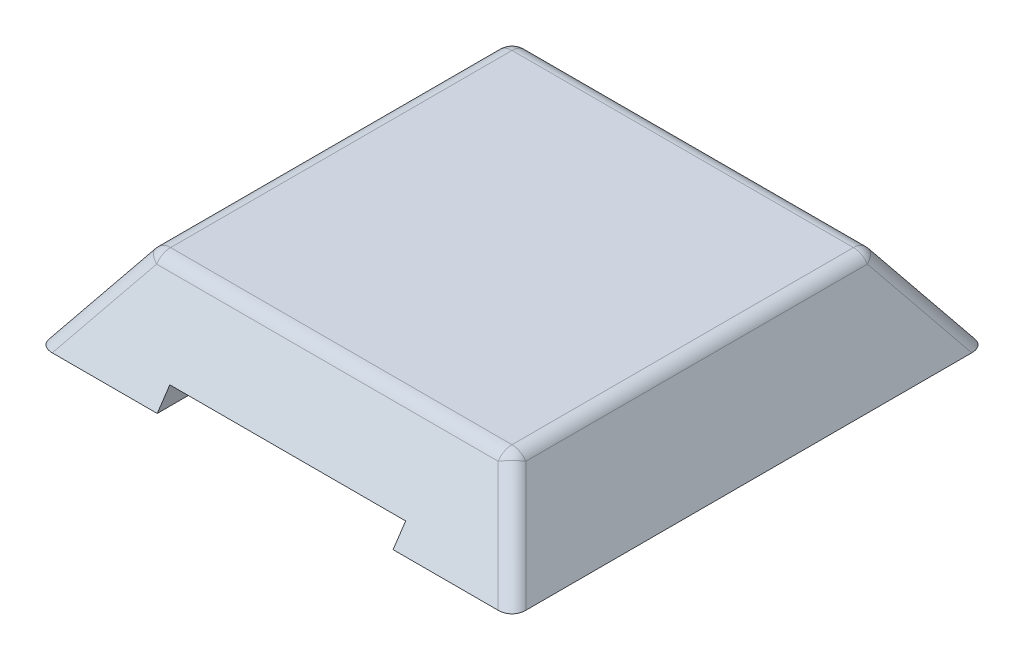
ISO-10303-21;
HEADER;
FILE_DESCRIPTION(('STEP AP214'),'2;1');
FILE_NAME('part.step','',(''),(''),'','','');
FILE_SCHEMA(('AUTOMOTIVE_DESIGN { 1 0 10303 214 1 1 1 1 }'));
ENDSEC;
DATA;
#1=APPLICATION_CONTEXT('core data for automotive mechanical design processes');
#2=APPLICATION_PROTOCOL_DEFINITION('international standard','automotive_design',2000,#1);
#3=PRODUCT_CONTEXT('',#1,'mechanical');
#4=PRODUCT('Part','Part','',(#3));
#5=PRODUCT_RELATED_PRODUCT_CATEGORY('part','',(#4));
#6=PRODUCT_DEFINITION_FORMATION('','',#4);
#7=PRODUCT_DEFINITION_CONTEXT('part definition',#1,'design');
#8=PRODUCT_DEFINITION('design','',#6,#7);
#9=PRODUCT_DEFINITION_SHAPE('','',#8);
#10=(LENGTH_UNIT() NAMED_UNIT(*) SI_UNIT(.MILLI.,.METRE.));
#11=(NAMED_UNIT(*) PLANE_ANGLE_UNIT() SI_UNIT($,.RADIAN.));
#12=(NAMED_UNIT(*) SI_UNIT($,.STERADIAN.) SOLID_ANGLE_UNIT());
#13=UNCERTAINTY_MEASURE_WITH_UNIT(LENGTH_MEASURE(1.E-05),#10,'distance_accuracy_value','');
#14=(GEOMETRIC_REPRESENTATION_CONTEXT(3) GLOBAL_UNCERTAINTY_ASSIGNED_CONTEXT((#13)) GLOBAL_UNIT_ASSIGNED_CONTEXT((#10,
#11,#12)) REPRESENTATION_CONTEXT('',''));
#15=CARTESIAN_POINT('',(0.,0.,0.));
#16=DIRECTION('',(0.,0.,1.));
#17=DIRECTION('',(1.,0.,0.));
#18=AXIS2_PLACEMENT_3D('',#15,#16,#17);
#19=CARTESIAN_POINT('',(0.,0.,0.));
#20=DIRECTION('',(0.,1.,0.));
#21=DIRECTION('',(0.,0.,1.));
#22=AXIS2_PLACEMENT_3D('',#19,#20,#21);
#23=PLANE('',#22);
#24=CARTESIAN_POINT('',(0.,0.,0.));
#25=DIRECTION('',(0.,-1.,0.));
#26=DIRECTION('',(0.,0.,-1.));
#27=AXIS2_PLACEMENT_3D('',#24,#25,#26);
#28=CIRCLE('',#27,1005.32293033056);
#29=CARTESIAN_POINT('',(0.,0.,-1005.32293033056));
#30=VERTEX_POINT('',#29);
#31=EDGE_CURVE('E866',#30,#30,#28,.T.);
#32=ORIENTED_EDGE('',*,*,#31,.F.);
#33=EDGE_LOOP('',(#32));
#34=FACE_BOUND('',#33,.T.);
#35=DIRECTION('',(0.,0.,-1.));
#36=VECTOR('',#35,1.);
#37=CARTESIAN_POINT('',(-700.,0.,0.));
#38=LINE('',#37,#36);
#39=CARTESIAN_POINT('',(-700.,0.,1406.));
#40=VERTEX_POINT('',#39);
#41=CARTESIAN_POINT('',(-700.,0.,1013.));
#42=VERTEX_POINT('',#41);
#43=EDGE_CURVE('E405',#40,#42,#38,.T.);
#44=ORIENTED_EDGE('',*,*,#43,.F.);
#45=DIRECTION('',(1.,0.,0.));
#46=VECTOR('',#45,1.);
#47=CARTESIAN_POINT('',(-1406.,0.,1406.));
#48=LINE('',#47,#46);
#49=CARTESIAN_POINT('',(-1323.28138305122,0.,1406.));
#50=VERTEX_POINT('',#49);
#51=EDGE_CURVE('E557',#50,#40,#48,.T.);
#52=ORIENTED_EDGE('',*,*,#51,.F.);
#53=CARTESIAN_POINT('',(-1285.10823018001,1.11022302462516E-13,1285.10823018001));
#54=DIRECTION('',(0.,1.,0.));
#55=DIRECTION('',(0.707106781186548,0.,-0.707106781186547));
#56=AXIS2_PLACEMENT_3D('',#53,#54,#55);
#57=ELLIPSE('',#56,138.670977570719,100.);
#58=CARTESIAN_POINT('',(-1406.,0.,1323.28138305122));
#59=VERTEX_POINT('',#58);
#60=EDGE_CURVE('E658',#50,#59,#57,.F.);
#61=ORIENTED_EDGE('',*,*,#60,.T.);
#62=DIRECTION('',(0.,0.,1.));
#63=VECTOR('',#62,1.);
#64=CARTESIAN_POINT('',(-1406.,0.,-1406.));
#65=LINE('',#64,#63);
#66=CARTESIAN_POINT('',(-1406.,0.,-1323.28138305122));
#67=VERTEX_POINT('',#66);
#68=EDGE_CURVE('E424',#67,#59,#65,.T.);
#69=ORIENTED_EDGE('',*,*,#68,.F.);
#70=CARTESIAN_POINT('',(-1285.10823018001,0.,-1285.10823018001));
#71=DIRECTION('',(0.,1.,0.));
#72=DIRECTION('',(0.707106781186548,0.,0.707106781186547));
#73=AXIS2_PLACEMENT_3D('',#70,#71,#72);
#74=ELLIPSE('',#73,138.670977570719,100.);
#75=CARTESIAN_POINT('',(-1323.28138305122,0.,-1406.));
#76=VERTEX_POINT('',#75);
#77=EDGE_CURVE('E569',#67,#76,#74,.F.);
#78=ORIENTED_EDGE('',*,*,#77,.T.);
#79=DIRECTION('',(-1.,0.,0.));
#80=VECTOR('',#79,1.);
#81=CARTESIAN_POINT('',(-1406.,0.,-1406.));
#82=LINE('',#81,#80);
#83=CARTESIAN_POINT('',(1323.28138305122,0.,-1406.));
#84=VERTEX_POINT('',#83);
#85=EDGE_CURVE('E418',#84,#76,#82,.T.);
#86=ORIENTED_EDGE('',*,*,#85,.F.);
#87=CARTESIAN_POINT('',(1285.10823018001,0.,-1285.10823018001));
#88=DIRECTION('',(0.,1.,0.));
#89=DIRECTION('',(-0.707106781186547,0.,0.707106781186548));
#90=AXIS2_PLACEMENT_3D('',#87,#88,#89);
#91=ELLIPSE('',#90,138.670977570719,100.);
#92=CARTESIAN_POINT('',(1406.,0.,-1323.28138305122));
#93=VERTEX_POINT('',#92);
#94=EDGE_CURVE('E616',#84,#93,#91,.F.);
#95=ORIENTED_EDGE('',*,*,#94,.T.);
#96=DIRECTION('',(0.,0.,-1.));
#97=VECTOR('',#96,1.);
#98=CARTESIAN_POINT('',(1406.,0.,-1406.));
#99=LINE('',#98,#97);
#100=CARTESIAN_POINT('',(1406.,0.,1323.28138305122));
#101=VERTEX_POINT('',#100);
#102=EDGE_CURVE('E576',#101,#93,#99,.T.);
#103=ORIENTED_EDGE('',*,*,#102,.F.);
#104=CARTESIAN_POINT('',(1285.10823018001,1.11022302462516E-13,1285.10823018001));
#105=DIRECTION('',(0.,1.,0.));
#106=DIRECTION('',(-0.707106781186548,0.,-0.707106781186548));
#107=AXIS2_PLACEMENT_3D('',#104,#105,#106);
#108=ELLIPSE('',#107,138.670977570719,100.);
#109=CARTESIAN_POINT('',(1323.28138305122,0.,1406.));
#110=VERTEX_POINT('',#109);
#111=EDGE_CURVE('E663',#101,#110,#108,.F.);
#112=ORIENTED_EDGE('',*,*,#111,.T.);
#113=CARTESIAN_POINT('',(700.,0.,1406.));
#114=VERTEX_POINT('',#113);
#115=EDGE_CURVE('E431',#114,#110,#48,.T.);
#116=ORIENTED_EDGE('',*,*,#115,.F.);
#117=DIRECTION('',(0.,0.,1.));
#118=VECTOR('',#117,1.);
#119=CARTESIAN_POINT('',(700.,0.,0.));
#120=LINE('',#119,#118);
#121=CARTESIAN_POINT('',(700.,0.,1013.));
#122=VERTEX_POINT('',#121);
#123=EDGE_CURVE('E402',#122,#114,#120,.T.);
#124=ORIENTED_EDGE('',*,*,#123,.F.);
#125=DIRECTION('',(1.,0.,0.));
#126=VECTOR('',#125,1.);
#127=CARTESIAN_POINT('',(0.,0.,1013.));
#128=LINE('',#127,#126);
#129=EDGE_CURVE('E108',#42,#122,#128,.T.);
#130=ORIENTED_EDGE('',*,*,#129,.F.);
#131=EDGE_LOOP('',(#44,#52,#61,#69,#78,#86,#95,#103,#112,#116,#124,#130));
#132=FACE_BOUND('',#131,.T.);
#133=ADVANCED_FACE('F99',(#34,#132),#23,.F.);
#134=CARTESIAN_POINT('',(-1406.,0.,1406.));
#135=DIRECTION('',(0.,0.561927967810891,0.827186169487814));
#136=DIRECTION('',(1.,0.,0.));
#137=AXIS2_PLACEMENT_3D('',#134,#135,#136);
#138=PLANE('',#137);
#139=ORIENTED_EDGE('',*,*,#51,.T.);
#140=DIRECTION('',(0.,0.827186169487814,-0.561927967810891));
#141=VECTOR('',#140,1.);
#142=CARTESIAN_POINT('',(-700.,0.,1406.));
#143=LINE('',#142,#141);
#144=CARTESIAN_POINT('',(-700.,110.,1331.27428680599));
#145=VERTEX_POINT('',#144);
#146=EDGE_CURVE('E755',#40,#145,#143,.T.);
#147=ORIENTED_EDGE('',*,*,#146,.T.);
#148=DIRECTION('',(1.,0.,0.));
#149=VECTOR('',#148,1.);
#150=CARTESIAN_POINT('',(-1406.,110.,1331.27428680599));
#151=LINE('',#150,#149);
#152=CARTESIAN_POINT('',(700.,110.,1331.27428680599));
#153=VERTEX_POINT('',#152);
#154=EDGE_CURVE('E618',#145,#153,#151,.T.);
#155=ORIENTED_EDGE('',*,*,#154,.T.);
#156=DIRECTION('',(0.,-0.827186169487814,0.561927967810891));
#157=VECTOR('',#156,1.);
#158=CARTESIAN_POINT('',(700.,0.,1406.));
#159=LINE('',#158,#157);
#160=EDGE_CURVE('E760',#153,#114,#159,.T.);
#161=ORIENTED_EDGE('',*,*,#160,.T.);
#162=ORIENTED_EDGE('',*,*,#115,.T.);
#163=DIRECTION('',(-0.48988236565481,0.721131427439475,-0.48988236565481));
#164=VECTOR('',#163,1.);
#165=CARTESIAN_POINT('',(668.295521297032,964.172059568059,751.014138245814));
#166=LINE('',#165,#164);
#167=CARTESIAN_POINT('',(1013.37836401997,456.192796781089,1096.09698096876));
#168=VERTEX_POINT('',#167);
#169=EDGE_CURVE('E560',#110,#168,#166,.T.);
#170=ORIENTED_EDGE('',*,*,#169,.T.);
#171=DIRECTION('',(1.,0.,0.));
#172=VECTOR('',#171,1.);
#173=CARTESIAN_POINT('',(-1406.,456.192796781089,1096.09698096876));
#174=LINE('',#173,#172);
#175=CARTESIAN_POINT('',(-1013.37836401997,456.192796781089,1096.09698096876));
#176=VERTEX_POINT('',#175);
#177=EDGE_CURVE('E709',#168,#176,#174,.F.);
#178=ORIENTED_EDGE('',*,*,#177,.T.);
#179=DIRECTION('',(0.489882365654811,0.721131427439474,-0.48988236565481));
#180=VECTOR('',#179,1.);
#181=CARTESIAN_POINT('',(-1343.13258818593,-29.2219702092297,1425.85120513472));
#182=LINE('',#181,#180);
#183=EDGE_CURVE('E563',#176,#50,#182,.F.);
#184=ORIENTED_EDGE('',*,*,#183,.T.);
#185=EDGE_LOOP('',(#139,#147,#155,#161,#162,#170,#178,#184));
#186=FACE_BOUND('',#185,.T.);
#187=ADVANCED_FACE('F450',(#186),#138,.T.);
#188=CARTESIAN_POINT('',(0.,500.,0.));
#189=DIRECTION('',(0.,1.,0.));
#190=DIRECTION('',(0.,0.,1.));
#191=AXIS2_PLACEMENT_3D('',#188,#189,#190);
#192=PLANE('',#191);
#193=DIRECTION('',(0.,0.,1.));
#194=VECTOR('',#193,1.);
#195=CARTESIAN_POINT('',(-1013.37836401997,500.,1.60039259230718E-13));
#196=LINE('',#195,#194);
#197=CARTESIAN_POINT('',(-1013.37836401997,500.,-1013.37836401997));
#198=VERTEX_POINT('',#197);
#199=CARTESIAN_POINT('',(-1013.37836401997,500.,1013.37836401997));
#200=VERTEX_POINT('',#199);
#201=EDGE_CURVE('E729',#198,#200,#196,.T.);
#202=ORIENTED_EDGE('',*,*,#201,.T.);
#203=DIRECTION('',(1.,0.,0.));
#204=VECTOR('',#203,1.);
#205=CARTESIAN_POINT('',(0.,500.,1013.37836401997));
#206=LINE('',#205,#204);
#207=CARTESIAN_POINT('',(1013.37836401997,500.,1013.37836401997));
#208=VERTEX_POINT('',#207);
#209=EDGE_CURVE('E721',#200,#208,#206,.T.);
#210=ORIENTED_EDGE('',*,*,#209,.T.);
#211=DIRECTION('',(0.,0.,-1.));
#212=VECTOR('',#211,1.);
#213=CARTESIAN_POINT('',(1013.37836401997,500.,-1.60039259230718E-13));
#214=LINE('',#213,#212);
#215=CARTESIAN_POINT('',(1013.37836401997,500.,-1013.37836401997));
#216=VERTEX_POINT('',#215);
#217=EDGE_CURVE('E423',#208,#216,#214,.T.);
#218=ORIENTED_EDGE('',*,*,#217,.T.);
#219=DIRECTION('',(-1.,0.,0.));
#220=VECTOR('',#219,1.);
#221=CARTESIAN_POINT('',(0.,500.,-1013.37836401997));
#222=LINE('',#221,#220);
#223=EDGE_CURVE('E743',#216,#198,#222,.T.);
#224=ORIENTED_EDGE('',*,*,#223,.T.);
#225=EDGE_LOOP('',(#202,#210,#218,#224));
#226=FACE_BOUND('',#225,.T.);
#227=ADVANCED_FACE('F458',(#226),#192,.T.);
#228=CARTESIAN_POINT('',(1406.,0.,-1406.));
#229=DIRECTION('',(0.,0.561927967810891,-0.827186169487814));
#230=DIRECTION('',(-1.,0.,0.));
#231=AXIS2_PLACEMENT_3D('',#228,#229,#230);
#232=PLANE('',#231);
#233=DIRECTION('',(-1.,0.,0.));
#234=VECTOR('',#233,1.);
#235=CARTESIAN_POINT('',(1406.,456.192796781089,-1096.09698096876));
#236=LINE('',#235,#234);
#237=CARTESIAN_POINT('',(-1013.37836401997,456.192796781089,-1096.09698096876));
#238=VERTEX_POINT('',#237);
#239=CARTESIAN_POINT('',(1013.37836401997,456.192796781089,-1096.09698096876));
#240=VERTEX_POINT('',#239);
#241=EDGE_CURVE('E602',#238,#240,#236,.F.);
#242=ORIENTED_EDGE('',*,*,#241,.T.);
#243=DIRECTION('',(-0.48988236565481,0.721131427439475,0.48988236565481));
#244=VECTOR('',#243,1.);
#245=CARTESIAN_POINT('',(1343.13258818593,-29.2219702092298,-1425.85120513472));
#246=LINE('',#245,#244);
#247=EDGE_CURVE('E604',#240,#84,#246,.F.);
#248=ORIENTED_EDGE('',*,*,#247,.T.);
#249=ORIENTED_EDGE('',*,*,#85,.T.);
#250=DIRECTION('',(0.489882365654811,0.721131427439474,0.48988236565481));
#251=VECTOR('',#250,1.);
#252=CARTESIAN_POINT('',(-668.295521297031,964.172059568059,-751.014138245813));
#253=LINE('',#252,#251);
#254=EDGE_CURVE('E605',#76,#238,#253,.T.);
#255=ORIENTED_EDGE('',*,*,#254,.T.);
#256=EDGE_LOOP('',(#242,#248,#249,#255));
#257=FACE_BOUND('',#256,.T.);
#258=ADVANCED_FACE('F587',(#257),#232,.T.);
#259=CARTESIAN_POINT('',(1406.,0.,1406.));
#260=DIRECTION('',(0.827186169487814,0.561927967810891,0.));
#261=DIRECTION('',(0.,0.,-1.));
#262=AXIS2_PLACEMENT_3D('',#259,#260,#261);
#263=PLANE('',#262);
#264=DIRECTION('',(0.,0.,-1.));
#265=VECTOR('',#264,1.);
#266=CARTESIAN_POINT('',(1096.09698096876,456.192796781089,1406.));
#267=LINE('',#266,#265);
#268=CARTESIAN_POINT('',(1096.09698096876,456.192796781089,-1013.37836401997));
#269=VERTEX_POINT('',#268);
#270=CARTESIAN_POINT('',(1096.09698096876,456.192796781089,1013.37836401997));
#271=VERTEX_POINT('',#270);
#272=EDGE_CURVE('E608',#269,#271,#267,.F.);
#273=ORIENTED_EDGE('',*,*,#272,.T.);
#274=DIRECTION('',(-0.48988236565481,0.721131427439475,-0.48988236565481));
#275=VECTOR('',#274,1.);
#276=CARTESIAN_POINT('',(1425.85120513472,-29.2219702092297,1343.13258818593));
#277=LINE('',#276,#275);
#278=EDGE_CURVE('E648',#271,#101,#277,.F.);
#279=ORIENTED_EDGE('',*,*,#278,.T.);
#280=ORIENTED_EDGE('',*,*,#102,.T.);
#281=DIRECTION('',(-0.48988236565481,0.721131427439475,0.48988236565481));
#282=VECTOR('',#281,1.);
#283=CARTESIAN_POINT('',(751.014138245813,964.172059568059,-668.295521297032));
#284=LINE('',#283,#282);
#285=EDGE_CURVE('E653',#93,#269,#284,.T.);
#286=ORIENTED_EDGE('',*,*,#285,.T.);
#287=EDGE_LOOP('',(#273,#279,#280,#286));
#288=FACE_BOUND('',#287,.T.);
#289=ADVANCED_FACE('F459',(#288),#263,.T.);
#290=CARTESIAN_POINT('',(-1406.,0.,-1406.));
#291=DIRECTION('',(-0.827186169487813,0.561927967810892,0.));
#292=DIRECTION('',(0.,0.,1.));
#293=AXIS2_PLACEMENT_3D('',#290,#291,#292);
#294=PLANE('',#293);
#295=ORIENTED_EDGE('',*,*,#68,.T.);
#296=DIRECTION('',(0.489882365654811,0.721131427439474,-0.48988236565481));
#297=VECTOR('',#296,1.);
#298=CARTESIAN_POINT('',(-751.014138245813,964.172059568058,668.295521297034));
#299=LINE('',#298,#297);
#300=CARTESIAN_POINT('',(-1096.09698096876,456.192796781089,1013.37836401997));
#301=VERTEX_POINT('',#300);
#302=EDGE_CURVE('E564',#59,#301,#299,.T.);
#303=ORIENTED_EDGE('',*,*,#302,.T.);
#304=DIRECTION('',(0.,0.,1.));
#305=VECTOR('',#304,1.);
#306=CARTESIAN_POINT('',(-1096.09698096876,456.192796781089,-1406.));
#307=LINE('',#306,#305);
#308=CARTESIAN_POINT('',(-1096.09698096876,456.192796781089,-1013.37836401997));
#309=VERTEX_POINT('',#308);
#310=EDGE_CURVE('E609',#301,#309,#307,.F.);
#311=ORIENTED_EDGE('',*,*,#310,.T.);
#312=DIRECTION('',(0.489882365654811,0.721131427439474,0.48988236565481));
#313=VECTOR('',#312,1.);
#314=CARTESIAN_POINT('',(-1425.85120513472,-29.2219702092296,-1343.13258818593));
#315=LINE('',#314,#313);
#316=EDGE_CURVE('E680',#309,#67,#315,.F.);
#317=ORIENTED_EDGE('',*,*,#316,.T.);
#318=EDGE_LOOP('',(#295,#303,#311,#317));
#319=FACE_BOUND('',#318,.T.);
#320=ADVANCED_FACE('F462',(#319),#294,.T.);
#321=CARTESIAN_POINT('',(0.,400.,-1013.37836401997));
#322=DIRECTION('',(-1.,0.,0.));
#323=DIRECTION('',(0.,0.,1.));
#324=AXIS2_PLACEMENT_3D('',#321,#322,#323);
#325=CYLINDRICAL_SURFACE('',#324,100.);
#326=ORIENTED_EDGE('',*,*,#223,.F.);
#327=CARTESIAN_POINT('',(1013.37836401997,400.,-1013.37836401997));
#328=DIRECTION('',(-1.,0.,0.));
#329=DIRECTION('',(0.,0.,1.));
#330=AXIS2_PLACEMENT_3D('',#327,#328,#329);
#331=CIRCLE('',#330,100.);
#332=EDGE_CURVE('E620',#216,#240,#331,.T.);
#333=ORIENTED_EDGE('',*,*,#332,.T.);
#334=ORIENTED_EDGE('',*,*,#241,.F.);
#335=CARTESIAN_POINT('',(-1013.37836401997,400.,-1013.37836401997));
#336=DIRECTION('',(-1.,0.,0.));
#337=DIRECTION('',(0.,0.,1.));
#338=AXIS2_PLACEMENT_3D('',#335,#336,#337);
#339=CIRCLE('',#338,100.);
#340=EDGE_CURVE('E683',#238,#198,#339,.F.);
#341=ORIENTED_EDGE('',*,*,#340,.T.);
#342=EDGE_LOOP('',(#326,#333,#334,#341));
#343=FACE_BOUND('',#342,.T.);
#344=ADVANCED_FACE('F466',(#343),#325,.T.);
#345=CARTESIAN_POINT('',(-1013.37836401997,400.,1.60039259230718E-13));
#346=DIRECTION('',(0.,0.,1.));
#347=DIRECTION('',(1.,0.,0.));
#348=AXIS2_PLACEMENT_3D('',#345,#346,#347);
#349=CYLINDRICAL_SURFACE('',#348,100.);
#350=ORIENTED_EDGE('',*,*,#310,.F.);
#351=CARTESIAN_POINT('',(-1013.37836401997,400.,1013.37836401997));
#352=DIRECTION('',(0.,0.,1.));
#353=DIRECTION('',(1.,0.,0.));
#354=AXIS2_PLACEMENT_3D('',#351,#352,#353);
#355=CIRCLE('',#354,100.);
#356=EDGE_CURVE('E706',#301,#200,#355,.F.);
#357=ORIENTED_EDGE('',*,*,#356,.T.);
#358=ORIENTED_EDGE('',*,*,#201,.F.);
#359=CARTESIAN_POINT('',(-1013.37836401997,400.,-1013.37836401997));
#360=DIRECTION('',(0.,0.,1.));
#361=DIRECTION('',(1.,0.,0.));
#362=AXIS2_PLACEMENT_3D('',#359,#360,#361);
#363=CIRCLE('',#362,100.);
#364=EDGE_CURVE('E682',#198,#309,#363,.T.);
#365=ORIENTED_EDGE('',*,*,#364,.T.);
#366=EDGE_LOOP('',(#350,#357,#358,#365));
#367=FACE_BOUND('',#366,.T.);
#368=ADVANCED_FACE('F476',(#367),#349,.T.);
#369=CARTESIAN_POINT('',(1013.37836401997,400.,-1.60039259230718E-13));
#370=DIRECTION('',(0.,0.,-1.));
#371=DIRECTION('',(-1.,0.,0.));
#372=AXIS2_PLACEMENT_3D('',#369,#370,#371);
#373=CYLINDRICAL_SURFACE('',#372,100.);
#374=ORIENTED_EDGE('',*,*,#217,.F.);
#375=CARTESIAN_POINT('',(1013.37836401997,400.,1013.37836401997));
#376=DIRECTION('',(0.,0.,-1.));
#377=DIRECTION('',(-1.,0.,0.));
#378=AXIS2_PLACEMENT_3D('',#375,#376,#377);
#379=CIRCLE('',#378,100.);
#380=EDGE_CURVE('E687',#208,#271,#379,.T.);
#381=ORIENTED_EDGE('',*,*,#380,.T.);
#382=ORIENTED_EDGE('',*,*,#272,.F.);
#383=CARTESIAN_POINT('',(1013.37836401997,400.,-1013.37836401997));
#384=DIRECTION('',(0.,0.,-1.));
#385=DIRECTION('',(-1.,0.,0.));
#386=AXIS2_PLACEMENT_3D('',#383,#384,#385);
#387=CIRCLE('',#386,100.);
#388=EDGE_CURVE('E622',#269,#216,#387,.F.);
#389=ORIENTED_EDGE('',*,*,#388,.T.);
#390=EDGE_LOOP('',(#374,#381,#382,#389));
#391=FACE_BOUND('',#390,.T.);
#392=ADVANCED_FACE('F472',(#391),#373,.T.);
#393=CARTESIAN_POINT('',(0.,400.,1013.37836401997));
#394=DIRECTION('',(1.,0.,0.));
#395=DIRECTION('',(0.,0.,-1.));
#396=AXIS2_PLACEMENT_3D('',#393,#394,#395);
#397=CYLINDRICAL_SURFACE('',#396,100.);
#398=ORIENTED_EDGE('',*,*,#209,.F.);
#399=CARTESIAN_POINT('',(-1013.37836401997,400.,1013.37836401997));
#400=DIRECTION('',(1.,0.,0.));
#401=DIRECTION('',(0.,0.,-1.));
#402=AXIS2_PLACEMENT_3D('',#399,#400,#401);
#403=CIRCLE('',#402,100.);
#404=EDGE_CURVE('E712',#200,#176,#403,.T.);
#405=ORIENTED_EDGE('',*,*,#404,.T.);
#406=ORIENTED_EDGE('',*,*,#177,.F.);
#407=CARTESIAN_POINT('',(1013.37836401997,400.,1013.37836401997));
#408=DIRECTION('',(1.,0.,0.));
#409=DIRECTION('',(0.,0.,-1.));
#410=AXIS2_PLACEMENT_3D('',#407,#408,#409);
#411=CIRCLE('',#410,100.);
#412=EDGE_CURVE('E723',#168,#208,#411,.F.);
#413=ORIENTED_EDGE('',*,*,#412,.T.);
#414=EDGE_LOOP('',(#398,#405,#406,#413));
#415=FACE_BOUND('',#414,.T.);
#416=ADVANCED_FACE('F468',(#415),#397,.T.);
#417=CARTESIAN_POINT('',(-668.295521297032,907.979262786968,668.295521297033));
#418=DIRECTION('',(0.489882365654811,0.721131427439474,-0.48988236565481));
#419=DIRECTION('',(-0.827186169487813,0.561927967810891,0.));
#420=AXIS2_PLACEMENT_3D('',#417,#418,#419);
#421=CYLINDRICAL_SURFACE('',#420,100.);
#422=ORIENTED_EDGE('',*,*,#60,.F.);
#423=ORIENTED_EDGE('',*,*,#183,.F.);
#424=CARTESIAN_POINT('',(-1013.37836401997,400.,1013.37836401997));
#425=DIRECTION('',(0.489882365654811,0.721131427439475,-0.489882365654809));
#426=DIRECTION('',(-0.827186169487814,0.561927967810891,0.));
#427=AXIS2_PLACEMENT_3D('',#424,#425,#426);
#428=CIRCLE('',#427,100.);
#429=EDGE_CURVE('E629',#301,#176,#428,.T.);
#430=ORIENTED_EDGE('',*,*,#429,.F.);
#431=ORIENTED_EDGE('',*,*,#302,.F.);
#432=EDGE_LOOP('',(#422,#423,#430,#431));
#433=FACE_BOUND('',#432,.T.);
#434=ADVANCED_FACE('F471',(#433),#421,.T.);
#435=CARTESIAN_POINT('',(-1013.37836401997,400.,1013.37836401997));
#436=DIRECTION('',(0.,0.,1.));
#437=DIRECTION('',(1.,0.,0.));
#438=AXIS2_PLACEMENT_3D('',#435,#436,#437);
#439=SPHERICAL_SURFACE('',#438,100.);
#440=ORIENTED_EDGE('',*,*,#404,.F.);
#441=ORIENTED_EDGE('',*,*,#356,.F.);
#442=ORIENTED_EDGE('',*,*,#429,.T.);
#443=EDGE_LOOP('',(#440,#441,#442));
#444=FACE_BOUND('',#443,.T.);
#445=ADVANCED_FACE('F484',(#444),#439,.T.);
#446=CARTESIAN_POINT('',(668.295521297032,907.979262786969,668.295521297032));
#447=DIRECTION('',(-0.48988236565481,0.721131427439475,-0.48988236565481));
#448=DIRECTION('',(0.,0.561927967810891,0.827186169487814));
#449=AXIS2_PLACEMENT_3D('',#446,#447,#448);
#450=CYLINDRICAL_SURFACE('',#449,100.);
#451=ORIENTED_EDGE('',*,*,#111,.F.);
#452=ORIENTED_EDGE('',*,*,#278,.F.);
#453=CARTESIAN_POINT('',(1013.37836401997,400.,1013.37836401997));
#454=DIRECTION('',(-0.48988236565481,0.721131427439475,-0.48988236565481));
#455=DIRECTION('',(0.,0.56192796781089,0.827186169487814));
#456=AXIS2_PLACEMENT_3D('',#453,#454,#455);
#457=CIRCLE('',#456,100.);
#458=EDGE_CURVE('E624',#168,#271,#457,.T.);
#459=ORIENTED_EDGE('',*,*,#458,.F.);
#460=ORIENTED_EDGE('',*,*,#169,.F.);
#461=EDGE_LOOP('',(#451,#452,#459,#460));
#462=FACE_BOUND('',#461,.T.);
#463=ADVANCED_FACE('F487',(#462),#450,.T.);
#464=CARTESIAN_POINT('',(1013.37836401997,400.,1013.37836401997));
#465=DIRECTION('',(0.,0.,1.));
#466=DIRECTION('',(1.,0.,0.));
#467=AXIS2_PLACEMENT_3D('',#464,#465,#466);
#468=SPHERICAL_SURFACE('',#467,100.);
#469=ORIENTED_EDGE('',*,*,#458,.T.);
#470=ORIENTED_EDGE('',*,*,#380,.F.);
#471=ORIENTED_EDGE('',*,*,#412,.F.);
#472=EDGE_LOOP('',(#469,#470,#471));
#473=FACE_BOUND('',#472,.T.);
#474=ADVANCED_FACE('F492',(#473),#468,.T.);
#475=CARTESIAN_POINT('',(668.295521297031,907.97926278697,-668.295521297032));
#476=DIRECTION('',(-0.48988236565481,0.721131427439475,0.48988236565481));
#477=DIRECTION('',(0.,-0.561927967810891,0.827186169487814));
#478=AXIS2_PLACEMENT_3D('',#475,#476,#477);
#479=CYLINDRICAL_SURFACE('',#478,100.);
#480=ORIENTED_EDGE('',*,*,#94,.F.);
#481=ORIENTED_EDGE('',*,*,#247,.F.);
#482=CARTESIAN_POINT('',(1013.37836401997,400.,-1013.37836401997));
#483=DIRECTION('',(-0.48988236565481,0.721131427439475,0.489882365654809));
#484=DIRECTION('',(-0.827186169487814,-0.56192796781089,0.));
#485=AXIS2_PLACEMENT_3D('',#482,#483,#484);
#486=CIRCLE('',#485,100.);
#487=EDGE_CURVE('E614',#269,#240,#486,.T.);
#488=ORIENTED_EDGE('',*,*,#487,.F.);
#489=ORIENTED_EDGE('',*,*,#285,.F.);
#490=EDGE_LOOP('',(#480,#481,#488,#489));
#491=FACE_BOUND('',#490,.T.);
#492=ADVANCED_FACE('F495',(#491),#479,.T.);
#493=CARTESIAN_POINT('',(1013.37836401997,400.,-1013.37836401997));
#494=DIRECTION('',(0.,0.,1.));
#495=DIRECTION('',(1.,0.,0.));
#496=AXIS2_PLACEMENT_3D('',#493,#494,#495);
#497=SPHERICAL_SURFACE('',#496,100.);
#498=ORIENTED_EDGE('',*,*,#487,.T.);
#499=ORIENTED_EDGE('',*,*,#332,.F.);
#500=ORIENTED_EDGE('',*,*,#388,.F.);
#501=EDGE_LOOP('',(#498,#499,#500));
#502=FACE_BOUND('',#501,.T.);
#503=ADVANCED_FACE('F500',(#502),#497,.T.);
#504=CARTESIAN_POINT('',(-668.295521297031,907.97926278697,-668.295521297031));
#505=DIRECTION('',(0.489882365654811,0.721131427439474,0.48988236565481));
#506=DIRECTION('',(-0.827186169487813,0.561927967810892,0.));
#507=AXIS2_PLACEMENT_3D('',#504,#505,#506);
#508=CYLINDRICAL_SURFACE('',#507,100.);
#509=ORIENTED_EDGE('',*,*,#77,.F.);
#510=ORIENTED_EDGE('',*,*,#316,.F.);
#511=CARTESIAN_POINT('',(-1013.37836401997,400.,-1013.37836401997));
#512=DIRECTION('',(0.489882365654812,0.721131427439474,0.489882365654809));
#513=DIRECTION('',(-0.827186169487813,0.561927967810893,0.));
#514=AXIS2_PLACEMENT_3D('',#511,#512,#513);
#515=CIRCLE('',#514,100.);
#516=EDGE_CURVE('E410',#238,#309,#515,.T.);
#517=ORIENTED_EDGE('',*,*,#516,.F.);
#518=ORIENTED_EDGE('',*,*,#254,.F.);
#519=EDGE_LOOP('',(#509,#510,#517,#518));
#520=FACE_BOUND('',#519,.T.);
#521=ADVANCED_FACE('F101',(#520),#508,.T.);
#522=CARTESIAN_POINT('',(-1013.37836401997,400.,-1013.37836401997));
#523=DIRECTION('',(0.,0.,1.));
#524=DIRECTION('',(1.,0.,0.));
#525=AXIS2_PLACEMENT_3D('',#522,#523,#524);
#526=SPHERICAL_SURFACE('',#525,100.);
#527=ORIENTED_EDGE('',*,*,#364,.F.);
#528=ORIENTED_EDGE('',*,*,#340,.F.);
#529=ORIENTED_EDGE('',*,*,#516,.T.);
#530=EDGE_LOOP('',(#527,#528,#529));
#531=FACE_BOUND('',#530,.T.);
#532=ADVANCED_FACE('F506',(#531),#526,.T.);
#533=CARTESIAN_POINT('',(0.,0.,1013.));
#534=DIRECTION('',(0.,0.,1.));
#535=DIRECTION('',(1.,0.,0.));
#536=AXIS2_PLACEMENT_3D('',#533,#534,#535);
#537=PLANE('',#536);
#538=ORIENTED_EDGE('',*,*,#129,.T.);
#539=DIRECTION('',(0.,1.,0.));
#540=VECTOR('',#539,1.);
#541=CARTESIAN_POINT('',(700.,-110.,1013.));
#542=LINE('',#541,#540);
#543=CARTESIAN_POINT('',(700.,110.,1013.));
#544=VERTEX_POINT('',#543);
#545=EDGE_CURVE('E388',#122,#544,#542,.T.);
#546=ORIENTED_EDGE('',*,*,#545,.T.);
#547=DIRECTION('',(-1.,0.,0.));
#548=VECTOR('',#547,1.);
#549=CARTESIAN_POINT('',(700.,110.,1013.));
#550=LINE('',#549,#548);
#551=CARTESIAN_POINT('',(-700.,110.,1013.));
#552=VERTEX_POINT('',#551);
#553=EDGE_CURVE('E391',#544,#552,#550,.T.);
#554=ORIENTED_EDGE('',*,*,#553,.T.);
#555=DIRECTION('',(0.,-1.,0.));
#556=VECTOR('',#555,1.);
#557=CARTESIAN_POINT('',(-700.,-110.,1013.));
#558=LINE('',#557,#556);
#559=EDGE_CURVE('E384',#552,#42,#558,.T.);
#560=ORIENTED_EDGE('',*,*,#559,.T.);
#561=EDGE_LOOP('',(#538,#546,#554,#560));
#562=FACE_BOUND('',#561,.T.);
#563=ADVANCED_FACE('F508',(#562),#537,.T.);
#564=CARTESIAN_POINT('',(-700.,-110.,1513.));
#565=DIRECTION('',(1.,0.,0.));
#566=DIRECTION('',(0.,0.,-1.));
#567=AXIS2_PLACEMENT_3D('',#564,#565,#566);
#568=PLANE('',#567);
#569=ORIENTED_EDGE('',*,*,#43,.T.);
#570=ORIENTED_EDGE('',*,*,#559,.F.);
#571=DIRECTION('',(0.,0.,-1.));
#572=VECTOR('',#571,1.);
#573=CARTESIAN_POINT('',(-700.,110.,1513.));
#574=LINE('',#573,#572);
#575=EDGE_CURVE('E395',#145,#552,#574,.T.);
#576=ORIENTED_EDGE('',*,*,#575,.F.);
#577=ORIENTED_EDGE('',*,*,#146,.F.);
#578=EDGE_LOOP('',(#569,#570,#576,#577));
#579=FACE_BOUND('',#578,.T.);
#580=ADVANCED_FACE('F514',(#579),#568,.T.);
#581=CARTESIAN_POINT('',(700.,-110.,1513.));
#582=DIRECTION('',(-1.,0.,0.));
#583=DIRECTION('',(0.,0.,1.));
#584=AXIS2_PLACEMENT_3D('',#581,#582,#583);
#585=PLANE('',#584);
#586=ORIENTED_EDGE('',*,*,#123,.T.);
#587=ORIENTED_EDGE('',*,*,#160,.F.);
#588=DIRECTION('',(0.,0.,-1.));
#589=VECTOR('',#588,1.);
#590=CARTESIAN_POINT('',(700.,110.,1513.));
#591=LINE('',#590,#589);
#592=EDGE_CURVE('E398',#153,#544,#591,.T.);
#593=ORIENTED_EDGE('',*,*,#592,.T.);
#594=ORIENTED_EDGE('',*,*,#545,.F.);
#595=EDGE_LOOP('',(#586,#587,#593,#594));
#596=FACE_BOUND('',#595,.T.);
#597=ADVANCED_FACE('F777',(#596),#585,.T.);
#598=CARTESIAN_POINT('',(700.,110.,1513.));
#599=DIRECTION('',(0.,-1.,0.));
#600=DIRECTION('',(1.,0.,0.));
#601=AXIS2_PLACEMENT_3D('',#598,#599,#600);
#602=PLANE('',#601);
#603=ORIENTED_EDGE('',*,*,#575,.T.);
#604=ORIENTED_EDGE('',*,*,#553,.F.);
#605=ORIENTED_EDGE('',*,*,#592,.F.);
#606=ORIENTED_EDGE('',*,*,#154,.F.);
#607=EDGE_LOOP('',(#603,#604,#605,#606));
#608=FACE_BOUND('',#607,.T.);
#609=ADVANCED_FACE('F769',(#608),#602,.T.);
#610=CARTESIAN_POINT('',(0.,-5.,0.));
#611=DIRECTION('',(0.,1.,0.));
#612=DIRECTION('',(0.,0.,1.));
#613=AXIS2_PLACEMENT_3D('',#610,#611,#612);
#614=CYLINDRICAL_SURFACE('',#613,1005.32293033056);
#615=CARTESIAN_POINT('',(0.,-5.,0.));
#616=DIRECTION('',(0.,-1.,0.));
#617=DIRECTION('',(0.,0.,-1.));
#618=AXIS2_PLACEMENT_3D('',#615,#616,#617);
#619=CIRCLE('',#618,1005.32293033056);
#620=CARTESIAN_POINT('',(710.870661319072,-5.,-710.870661319072));
#621=VERTEX_POINT('',#620);
#622=CARTESIAN_POINT('',(710.870661319072,-5.,710.870661319072));
#623=VERTEX_POINT('',#622);
#624=EDGE_CURVE('E295',#621,#623,#619,.T.);
#625=ORIENTED_EDGE('',*,*,#624,.F.);
#626=CARTESIAN_POINT('',(-710.870661319072,-5.,-710.870661319072));
#627=VERTEX_POINT('',#626);
#628=EDGE_CURVE('E860',#627,#621,#619,.T.);
#629=ORIENTED_EDGE('',*,*,#628,.F.);
#630=CARTESIAN_POINT('',(-710.870661319072,-5.,710.870661319072));
#631=VERTEX_POINT('',#630);
#632=EDGE_CURVE('E863',#631,#627,#619,.T.);
#633=ORIENTED_EDGE('',*,*,#632,.F.);
#634=EDGE_CURVE('E858',#623,#631,#619,.T.);
#635=ORIENTED_EDGE('',*,*,#634,.F.);
#636=EDGE_LOOP('',(#625,#629,#633,#635));
#637=FACE_BOUND('',#636,.T.);
#638=ORIENTED_EDGE('',*,*,#31,.T.);
#639=EDGE_LOOP('',(#638));
#640=FACE_BOUND('',#639,.T.);
#641=ADVANCED_FACE('F783',(#637,#640),#614,.T.);
#642=CARTESIAN_POINT('',(0.,-5.,0.));
#643=DIRECTION('',(0.,-1.,0.));
#644=DIRECTION('',(0.,0.,-1.));
#645=AXIS2_PLACEMENT_3D('',#642,#643,#644);
#646=PLANE('',#645);
#647=DIRECTION('',(1.,0.,0.));
#648=VECTOR('',#647,1.);
#649=CARTESIAN_POINT('',(0.,-5.,-710.870661319072));
#650=LINE('',#649,#648);
#651=CARTESIAN_POINT('',(410.870661319072,-5.,-710.870661319072));
#652=VERTEX_POINT('',#651);
#653=EDGE_CURVE('E122',#652,#621,#650,.T.);
#654=ORIENTED_EDGE('',*,*,#653,.F.);
#655=DIRECTION('',(0.,0.,1.));
#656=VECTOR('',#655,1.);
#657=CARTESIAN_POINT('',(410.870661319072,-5.,0.));
#658=LINE('',#657,#656);
#659=CARTESIAN_POINT('',(410.870661319072,-5.,-110.870661319072));
#660=VERTEX_POINT('',#659);
#661=EDGE_CURVE('E115',#652,#660,#658,.T.);
#662=ORIENTED_EDGE('',*,*,#661,.T.);
#663=DIRECTION('',(-1.,0.,0.));
#664=VECTOR('',#663,1.);
#665=CARTESIAN_POINT('',(0.,-5.,-110.870661319072));
#666=LINE('',#665,#664);
#667=CARTESIAN_POINT('',(-404.434082872768,-5.,-110.870661319072));
#668=VERTEX_POINT('',#667);
#669=EDGE_CURVE('E13',#660,#668,#666,.T.);
#670=ORIENTED_EDGE('',*,*,#669,.T.);
#671=DIRECTION('',(0.,0.,1.));
#672=VECTOR('',#671,1.);
#673=CARTESIAN_POINT('',(-404.434082872768,-5.,0.));
#674=LINE('',#673,#672);
#675=CARTESIAN_POINT('',(-404.434082872768,-5.,-710.870661319072));
#676=VERTEX_POINT('',#675);
#677=EDGE_CURVE('E288',#676,#668,#674,.T.);
#678=ORIENTED_EDGE('',*,*,#677,.F.);
#679=DIRECTION('',(1.,0.,0.));
#680=VECTOR('',#679,1.);
#681=CARTESIAN_POINT('',(0.,-5.,-710.870661319072));
#682=LINE('',#681,#680);
#683=EDGE_CURVE('E294',#627,#676,#682,.T.);
#684=ORIENTED_EDGE('',*,*,#683,.F.);
#685=ORIENTED_EDGE('',*,*,#628,.T.);
#686=EDGE_LOOP('',(#654,#662,#670,#678,#684,#685));
#687=FACE_BOUND('',#686,.T.);
#688=ADVANCED_FACE('F297',(#687),#646,.T.);
#689=ORIENTED_EDGE('',*,*,#624,.T.);
#690=DIRECTION('',(0.,0.,-1.));
#691=VECTOR('',#690,1.);
#692=CARTESIAN_POINT('',(710.870661319072,-5.,1.11022302462516E-13));
#693=LINE('',#692,#691);
#694=EDGE_CURVE('E307',#623,#621,#693,.T.);
#695=ORIENTED_EDGE('',*,*,#694,.T.);
#696=EDGE_LOOP('',(#689,#695));
#697=FACE_BOUND('',#696,.T.);
#698=ADVANCED_FACE('F842',(#697),#646,.T.);
#699=DIRECTION('',(0.,0.,-1.));
#700=VECTOR('',#699,1.);
#701=CARTESIAN_POINT('',(-710.870661319072,-5.,-1.11022302462516E-13));
#702=LINE('',#701,#700);
#703=EDGE_CURVE('E875',#631,#627,#702,.T.);
#704=ORIENTED_EDGE('',*,*,#703,.F.);
#705=ORIENTED_EDGE('',*,*,#632,.T.);
#706=EDGE_LOOP('',(#704,#705));
#707=FACE_BOUND('',#706,.T.);
#708=ADVANCED_FACE('F837',(#707),#646,.T.);
#709=DIRECTION('',(0.,0.,-1.));
#710=VECTOR('',#709,1.);
#711=CARTESIAN_POINT('',(410.870661319072,-5.,0.));
#712=LINE('',#711,#710);
#713=CARTESIAN_POINT('',(410.870661319072,-5.,710.870661319072));
#714=VERTEX_POINT('',#713);
#715=CARTESIAN_POINT('',(410.870661319072,-5.,110.870661319072));
#716=VERTEX_POINT('',#715);
#717=EDGE_CURVE('E889',#714,#716,#712,.T.);
#718=ORIENTED_EDGE('',*,*,#717,.F.);
#719=DIRECTION('',(1.,0.,0.));
#720=VECTOR('',#719,1.);
#721=CARTESIAN_POINT('',(0.,-5.,710.870661319072));
#722=LINE('',#721,#720);
#723=EDGE_CURVE('E892',#714,#623,#722,.T.);
#724=ORIENTED_EDGE('',*,*,#723,.T.);
#725=ORIENTED_EDGE('',*,*,#634,.T.);
#726=DIRECTION('',(1.,0.,0.));
#727=VECTOR('',#726,1.);
#728=CARTESIAN_POINT('',(0.,-5.,710.870661319072));
#729=LINE('',#728,#727);
#730=CARTESIAN_POINT('',(-404.434082872768,-5.,710.870661319072));
#731=VERTEX_POINT('',#730);
#732=EDGE_CURVE('E878',#631,#731,#729,.T.);
#733=ORIENTED_EDGE('',*,*,#732,.T.);
#734=DIRECTION('',(0.,0.,-1.));
#735=VECTOR('',#734,1.);
#736=CARTESIAN_POINT('',(-404.434082872768,-5.,0.));
#737=LINE('',#736,#735);
#738=CARTESIAN_POINT('',(-404.434082872768,-5.,110.870661319072));
#739=VERTEX_POINT('',#738);
#740=EDGE_CURVE('E882',#731,#739,#737,.T.);
#741=ORIENTED_EDGE('',*,*,#740,.T.);
#742=DIRECTION('',(-1.,0.,0.));
#743=VECTOR('',#742,1.);
#744=CARTESIAN_POINT('',(0.,-5.,110.870661319072));
#745=LINE('',#744,#743);
#746=EDGE_CURVE('E886',#716,#739,#745,.T.);
#747=ORIENTED_EDGE('',*,*,#746,.F.);
#748=EDGE_LOOP('',(#718,#724,#725,#733,#741,#747));
#749=FACE_BOUND('',#748,.T.);
#750=ADVANCED_FACE('F831',(#749),#646,.T.);
#751=CARTESIAN_POINT('',(0.,-10.,0.));
#752=DIRECTION('',(0.,-1.,0.));
#753=DIRECTION('',(0.,0.,-1.));
#754=AXIS2_PLACEMENT_3D('',#751,#752,#753);
#755=PLANE('',#754);
#756=DIRECTION('',(0.,0.,1.));
#757=VECTOR('',#756,1.);
#758=CARTESIAN_POINT('',(410.870661319072,-10.,0.));
#759=LINE('',#758,#757);
#760=CARTESIAN_POINT('',(410.870661319072,-10.,-710.870661319072));
#761=VERTEX_POINT('',#760);
#762=CARTESIAN_POINT('',(410.870661319072,-10.,-110.870661319072));
#763=VERTEX_POINT('',#762);
#764=EDGE_CURVE('E300',#761,#763,#759,.T.);
#765=ORIENTED_EDGE('',*,*,#764,.F.);
#766=DIRECTION('',(1.,0.,0.));
#767=VECTOR('',#766,1.);
#768=CARTESIAN_POINT('',(0.,-10.,-710.870661319072));
#769=LINE('',#768,#767);
#770=CARTESIAN_POINT('',(710.870661319072,-10.,-710.870661319072));
#771=VERTEX_POINT('',#770);
#772=EDGE_CURVE('E305',#761,#771,#769,.T.);
#773=ORIENTED_EDGE('',*,*,#772,.T.);
#774=DIRECTION('',(0.,0.,-1.));
#775=VECTOR('',#774,1.);
#776=CARTESIAN_POINT('',(710.870661319072,-10.,1.11022302462516E-13));
#777=LINE('',#776,#775);
#778=CARTESIAN_POINT('',(710.870661319072,-10.,710.870661319072));
#779=VERTEX_POINT('',#778);
#780=EDGE_CURVE('E313',#779,#771,#777,.T.);
#781=ORIENTED_EDGE('',*,*,#780,.F.);
#782=DIRECTION('',(1.,0.,0.));
#783=VECTOR('',#782,1.);
#784=CARTESIAN_POINT('',(0.,-10.,710.870661319072));
#785=LINE('',#784,#783);
#786=CARTESIAN_POINT('',(410.870661319072,-10.,710.870661319072));
#787=VERTEX_POINT('',#786);
#788=EDGE_CURVE('E317',#787,#779,#785,.T.);
#789=ORIENTED_EDGE('',*,*,#788,.F.);
#790=DIRECTION('',(0.,0.,-1.));
#791=VECTOR('',#790,1.);
#792=CARTESIAN_POINT('',(410.870661319072,-10.,0.));
#793=LINE('',#792,#791);
#794=CARTESIAN_POINT('',(410.870661319072,-10.,110.870661319072));
#795=VERTEX_POINT('',#794);
#796=EDGE_CURVE('E321',#787,#795,#793,.T.);
#797=ORIENTED_EDGE('',*,*,#796,.T.);
#798=DIRECTION('',(-1.,0.,0.));
#799=VECTOR('',#798,1.);
#800=CARTESIAN_POINT('',(0.,-10.,110.870661319072));
#801=LINE('',#800,#799);
#802=CARTESIAN_POINT('',(-404.434082872768,-10.,110.870661319072));
#803=VERTEX_POINT('',#802);
#804=EDGE_CURVE('E324',#795,#803,#801,.T.);
#805=ORIENTED_EDGE('',*,*,#804,.T.);
#806=DIRECTION('',(0.,0.,-1.));
#807=VECTOR('',#806,1.);
#808=CARTESIAN_POINT('',(-404.434082872768,-10.,0.));
#809=LINE('',#808,#807);
#810=CARTESIAN_POINT('',(-404.434082872768,-10.,710.870661319072));
#811=VERTEX_POINT('',#810);
#812=EDGE_CURVE('E327',#811,#803,#809,.T.);
#813=ORIENTED_EDGE('',*,*,#812,.F.);
#814=DIRECTION('',(1.,0.,0.));
#815=VECTOR('',#814,1.);
#816=CARTESIAN_POINT('',(0.,-10.,710.870661319072));
#817=LINE('',#816,#815);
#818=CARTESIAN_POINT('',(-710.870661319072,-10.,710.870661319072));
#819=VERTEX_POINT('',#818);
#820=EDGE_CURVE('E331',#819,#811,#817,.T.);
#821=ORIENTED_EDGE('',*,*,#820,.F.);
#822=DIRECTION('',(0.,0.,-1.));
#823=VECTOR('',#822,1.);
#824=CARTESIAN_POINT('',(-710.870661319072,-10.,-1.11022302462516E-13));
#825=LINE('',#824,#823);
#826=CARTESIAN_POINT('',(-710.870661319072,-10.,-710.870661319072));
#827=VERTEX_POINT('',#826);
#828=EDGE_CURVE('E335',#819,#827,#825,.T.);
#829=ORIENTED_EDGE('',*,*,#828,.T.);
#830=DIRECTION('',(1.,0.,0.));
#831=VECTOR('',#830,1.);
#832=CARTESIAN_POINT('',(0.,-10.,-710.870661319072));
#833=LINE('',#832,#831);
#834=CARTESIAN_POINT('',(-404.434082872768,-10.,-710.870661319072));
#835=VERTEX_POINT('',#834);
#836=EDGE_CURVE('E338',#827,#835,#833,.T.);
#837=ORIENTED_EDGE('',*,*,#836,.T.);
#838=DIRECTION('',(0.,0.,1.));
#839=VECTOR('',#838,1.);
#840=CARTESIAN_POINT('',(-404.434082872768,-10.,0.));
#841=LINE('',#840,#839);
#842=CARTESIAN_POINT('',(-404.434082872768,-10.,-110.870661319072));
#843=VERTEX_POINT('',#842);
#844=EDGE_CURVE('E341',#835,#843,#841,.T.);
#845=ORIENTED_EDGE('',*,*,#844,.T.);
#846=DIRECTION('',(-1.,0.,0.));
#847=VECTOR('',#846,1.);
#848=CARTESIAN_POINT('',(0.,-10.,-110.870661319072));
#849=LINE('',#848,#847);
#850=EDGE_CURVE('E279',#763,#843,#849,.T.);
#851=ORIENTED_EDGE('',*,*,#850,.F.);
#852=EDGE_LOOP('',(#765,#773,#781,#789,#797,#805,#813,#821,#829,#837,#845,#851));
#853=FACE_BOUND('',#852,.T.);
#854=ADVANCED_FACE('F828',(#853),#755,.T.);
#855=CARTESIAN_POINT('',(0.,-10.,-110.870661319072));
#856=DIRECTION('',(0.,0.,-1.));
#857=DIRECTION('',(-1.,0.,0.));
#858=AXIS2_PLACEMENT_3D('',#855,#856,#857);
#859=PLANE('',#858);
#860=ORIENTED_EDGE('',*,*,#669,.F.);
#861=DIRECTION('',(0.,1.,0.));
#862=VECTOR('',#861,1.);
#863=CARTESIAN_POINT('',(410.870661319072,-10.,-110.870661319072));
#864=LINE('',#863,#862);
#865=EDGE_CURVE('E284',#763,#660,#864,.T.);
#866=ORIENTED_EDGE('',*,*,#865,.F.);
#867=ORIENTED_EDGE('',*,*,#850,.T.);
#868=DIRECTION('',(0.,1.,0.));
#869=VECTOR('',#868,1.);
#870=CARTESIAN_POINT('',(-404.434082872768,-10.,-110.870661319072));
#871=LINE('',#870,#869);
#872=EDGE_CURVE('E275',#843,#668,#871,.T.);
#873=ORIENTED_EDGE('',*,*,#872,.T.);
#874=EDGE_LOOP('',(#860,#866,#867,#873));
#875=FACE_BOUND('',#874,.T.);
#876=ADVANCED_FACE('F277',(#875),#859,.T.);
#877=CARTESIAN_POINT('',(-404.434082872768,-10.,0.));
#878=DIRECTION('',(-1.,0.,0.));
#879=DIRECTION('',(0.,0.,1.));
#880=AXIS2_PLACEMENT_3D('',#877,#878,#879);
#881=PLANE('',#880);
#882=DIRECTION('',(0.,1.,0.));
#883=VECTOR('',#882,1.);
#884=CARTESIAN_POINT('',(-404.434082872768,-10.,-710.870661319072));
#885=LINE('',#884,#883);
#886=EDGE_CURVE('E283',#835,#676,#885,.T.);
#887=ORIENTED_EDGE('',*,*,#886,.T.);
#888=ORIENTED_EDGE('',*,*,#677,.T.);
#889=ORIENTED_EDGE('',*,*,#872,.F.);
#890=ORIENTED_EDGE('',*,*,#844,.F.);
#891=EDGE_LOOP('',(#887,#888,#889,#890));
#892=FACE_BOUND('',#891,.T.);
#893=ADVANCED_FACE('F289',(#892),#881,.F.);
#894=CARTESIAN_POINT('',(0.,-10.,-710.870661319072));
#895=DIRECTION('',(0.,0.,1.));
#896=DIRECTION('',(1.,0.,0.));
#897=AXIS2_PLACEMENT_3D('',#894,#895,#896);
#898=PLANE('',#897);
#899=DIRECTION('',(0.,1.,0.));
#900=VECTOR('',#899,1.);
#901=CARTESIAN_POINT('',(-710.870661319072,-10.,-710.870661319072));
#902=LINE('',#901,#900);
#903=EDGE_CURVE('E350',#827,#627,#902,.T.);
#904=ORIENTED_EDGE('',*,*,#903,.T.);
#905=ORIENTED_EDGE('',*,*,#683,.T.);
#906=ORIENTED_EDGE('',*,*,#886,.F.);
#907=ORIENTED_EDGE('',*,*,#836,.F.);
#908=EDGE_LOOP('',(#904,#905,#906,#907));
#909=FACE_BOUND('',#908,.T.);
#910=ADVANCED_FACE('F819',(#909),#898,.F.);
#911=CARTESIAN_POINT('',(-710.870661319072,-10.,-1.11022302462516E-13));
#912=DIRECTION('',(1.,0.,0.));
#913=DIRECTION('',(0.,0.,-1.));
#914=AXIS2_PLACEMENT_3D('',#911,#912,#913);
#915=PLANE('',#914);
#916=DIRECTION('',(0.,1.,0.));
#917=VECTOR('',#916,1.);
#918=CARTESIAN_POINT('',(-710.870661319072,-10.,710.870661319072));
#919=LINE('',#918,#917);
#920=EDGE_CURVE('E354',#819,#631,#919,.T.);
#921=ORIENTED_EDGE('',*,*,#920,.T.);
#922=ORIENTED_EDGE('',*,*,#703,.T.);
#923=ORIENTED_EDGE('',*,*,#903,.F.);
#924=ORIENTED_EDGE('',*,*,#828,.F.);
#925=EDGE_LOOP('',(#921,#922,#923,#924));
#926=FACE_BOUND('',#925,.T.);
#927=ADVANCED_FACE('F815',(#926),#915,.F.);
#928=CARTESIAN_POINT('',(0.,-10.,710.870661319072));
#929=DIRECTION('',(0.,0.,1.));
#930=DIRECTION('',(1.,0.,0.));
#931=AXIS2_PLACEMENT_3D('',#928,#929,#930);
#932=PLANE('',#931);
#933=ORIENTED_EDGE('',*,*,#732,.F.);
#934=ORIENTED_EDGE('',*,*,#920,.F.);
#935=ORIENTED_EDGE('',*,*,#820,.T.);
#936=DIRECTION('',(0.,1.,0.));
#937=VECTOR('',#936,1.);
#938=CARTESIAN_POINT('',(-404.434082872768,-10.,710.870661319072));
#939=LINE('',#938,#937);
#940=EDGE_CURVE('E358',#811,#731,#939,.T.);
#941=ORIENTED_EDGE('',*,*,#940,.T.);
#942=EDGE_LOOP('',(#933,#934,#935,#941));
#943=FACE_BOUND('',#942,.T.);
#944=ADVANCED_FACE('F811',(#943),#932,.T.);
#945=CARTESIAN_POINT('',(-404.434082872768,-10.,0.));
#946=DIRECTION('',(1.,0.,0.));
#947=DIRECTION('',(0.,0.,-1.));
#948=AXIS2_PLACEMENT_3D('',#945,#946,#947);
#949=PLANE('',#948);
#950=ORIENTED_EDGE('',*,*,#740,.F.);
#951=ORIENTED_EDGE('',*,*,#940,.F.);
#952=ORIENTED_EDGE('',*,*,#812,.T.);
#953=DIRECTION('',(0.,1.,0.));
#954=VECTOR('',#953,1.);
#955=CARTESIAN_POINT('',(-404.434082872768,-10.,110.870661319072));
#956=LINE('',#955,#954);
#957=EDGE_CURVE('E362',#803,#739,#956,.T.);
#958=ORIENTED_EDGE('',*,*,#957,.T.);
#959=EDGE_LOOP('',(#950,#951,#952,#958));
#960=FACE_BOUND('',#959,.T.);
#961=ADVANCED_FACE('F807',(#960),#949,.T.);
#962=CARTESIAN_POINT('',(0.,-10.,110.870661319072));
#963=DIRECTION('',(0.,0.,-1.));
#964=DIRECTION('',(-1.,0.,0.));
#965=AXIS2_PLACEMENT_3D('',#962,#963,#964);
#966=PLANE('',#965);
#967=DIRECTION('',(0.,1.,0.));
#968=VECTOR('',#967,1.);
#969=CARTESIAN_POINT('',(410.870661319072,-10.,110.870661319072));
#970=LINE('',#969,#968);
#971=EDGE_CURVE('E366',#795,#716,#970,.T.);
#972=ORIENTED_EDGE('',*,*,#971,.T.);
#973=ORIENTED_EDGE('',*,*,#746,.T.);
#974=ORIENTED_EDGE('',*,*,#957,.F.);
#975=ORIENTED_EDGE('',*,*,#804,.F.);
#976=EDGE_LOOP('',(#972,#973,#974,#975));
#977=FACE_BOUND('',#976,.T.);
#978=ADVANCED_FACE('F803',(#977),#966,.F.);
#979=CARTESIAN_POINT('',(410.870661319072,-10.,0.));
#980=DIRECTION('',(1.,0.,0.));
#981=DIRECTION('',(0.,0.,-1.));
#982=AXIS2_PLACEMENT_3D('',#979,#980,#981);
#983=PLANE('',#982);
#984=DIRECTION('',(0.,1.,0.));
#985=VECTOR('',#984,1.);
#986=CARTESIAN_POINT('',(410.870661319072,-10.,710.870661319072));
#987=LINE('',#986,#985);
#988=EDGE_CURVE('E370',#787,#714,#987,.T.);
#989=ORIENTED_EDGE('',*,*,#988,.T.);
#990=ORIENTED_EDGE('',*,*,#717,.T.);
#991=ORIENTED_EDGE('',*,*,#971,.F.);
#992=ORIENTED_EDGE('',*,*,#796,.F.);
#993=EDGE_LOOP('',(#989,#990,#991,#992));
#994=FACE_BOUND('',#993,.T.);
#995=ADVANCED_FACE('F799',(#994),#983,.F.);
#996=CARTESIAN_POINT('',(0.,-10.,710.870661319072));
#997=DIRECTION('',(0.,0.,1.));
#998=DIRECTION('',(1.,0.,0.));
#999=AXIS2_PLACEMENT_3D('',#996,#997,#998);
#1000=PLANE('',#999);
#1001=ORIENTED_EDGE('',*,*,#723,.F.);
#1002=ORIENTED_EDGE('',*,*,#988,.F.);
#1003=ORIENTED_EDGE('',*,*,#788,.T.);
#1004=DIRECTION('',(0.,1.,0.));
#1005=VECTOR('',#1004,1.);
#1006=CARTESIAN_POINT('',(710.870661319072,-10.,710.870661319072));
#1007=LINE('',#1006,#1005);
#1008=EDGE_CURVE('E374',#779,#623,#1007,.T.);
#1009=ORIENTED_EDGE('',*,*,#1008,.T.);
#1010=EDGE_LOOP('',(#1001,#1002,#1003,#1009));
#1011=FACE_BOUND('',#1010,.T.);
#1012=ADVANCED_FACE('F795',(#1011),#1000,.T.);
#1013=CARTESIAN_POINT('',(710.870661319072,-10.,1.11022302462516E-13));
#1014=DIRECTION('',(1.,0.,0.));
#1015=DIRECTION('',(0.,0.,-1.));
#1016=AXIS2_PLACEMENT_3D('',#1013,#1014,#1015);
#1017=PLANE('',#1016);
#1018=ORIENTED_EDGE('',*,*,#694,.F.);
#1019=ORIENTED_EDGE('',*,*,#1008,.F.);
#1020=ORIENTED_EDGE('',*,*,#780,.T.);
#1021=DIRECTION('',(0.,1.,0.));
#1022=VECTOR('',#1021,1.);
#1023=CARTESIAN_POINT('',(710.870661319072,-10.,-710.870661319072));
#1024=LINE('',#1023,#1022);
#1025=EDGE_CURVE('E378',#771,#621,#1024,.T.);
#1026=ORIENTED_EDGE('',*,*,#1025,.T.);
#1027=EDGE_LOOP('',(#1018,#1019,#1020,#1026));
#1028=FACE_BOUND('',#1027,.T.);
#1029=ADVANCED_FACE('F792',(#1028),#1017,.T.);
#1030=CARTESIAN_POINT('',(0.,-10.,-710.870661319072));
#1031=DIRECTION('',(0.,0.,1.));
#1032=DIRECTION('',(1.,0.,0.));
#1033=AXIS2_PLACEMENT_3D('',#1030,#1031,#1032);
#1034=PLANE('',#1033);
#1035=DIRECTION('',(0.,1.,0.));
#1036=VECTOR('',#1035,1.);
#1037=CARTESIAN_POINT('',(410.870661319072,-10.,-710.870661319072));
#1038=LINE('',#1037,#1036);
#1039=EDGE_CURVE('E381',#761,#652,#1038,.T.);
#1040=ORIENTED_EDGE('',*,*,#1039,.T.);
#1041=ORIENTED_EDGE('',*,*,#653,.T.);
#1042=ORIENTED_EDGE('',*,*,#1025,.F.);
#1043=ORIENTED_EDGE('',*,*,#772,.F.);
#1044=EDGE_LOOP('',(#1040,#1041,#1042,#1043));
#1045=FACE_BOUND('',#1044,.T.);
#1046=ADVANCED_FACE('F789',(#1045),#1034,.F.);
#1047=CARTESIAN_POINT('',(410.870661319072,-10.,0.));
#1048=DIRECTION('',(-1.,0.,0.));
#1049=DIRECTION('',(0.,0.,1.));
#1050=AXIS2_PLACEMENT_3D('',#1047,#1048,#1049);
#1051=PLANE('',#1050);
#1052=ORIENTED_EDGE('',*,*,#661,.F.);
#1053=ORIENTED_EDGE('',*,*,#1039,.F.);
#1054=ORIENTED_EDGE('',*,*,#764,.T.);
#1055=ORIENTED_EDGE('',*,*,#865,.T.);
#1056=EDGE_LOOP('',(#1052,#1053,#1054,#1055));
#1057=FACE_BOUND('',#1056,.T.);
#1058=ADVANCED_FACE('F786',(#1057),#1051,.T.);
#1059=CLOSED_SHELL('',(#133,#187,#227,#258,#289,#320,#344,#368,#392,#416,#434,#445,#463,#474,
#492,#503,#521,#532,#563,#580,#597,#609,#641,#688,#698,#708,#750,#854,#876,#893,#910,#927,#944,
#961,#978,#995,#1012,#1029,#1046,#1058));
#1060=MANIFOLD_SOLID_BREP('B2',#1059);
#1061=ADVANCED_BREP_SHAPE_REPRESENTATION('',(#18,#1060),#14);
#1062=SHAPE_DEFINITION_REPRESENTATION(#9,#1061);
ENDSEC;
END-ISO-10303-21;
